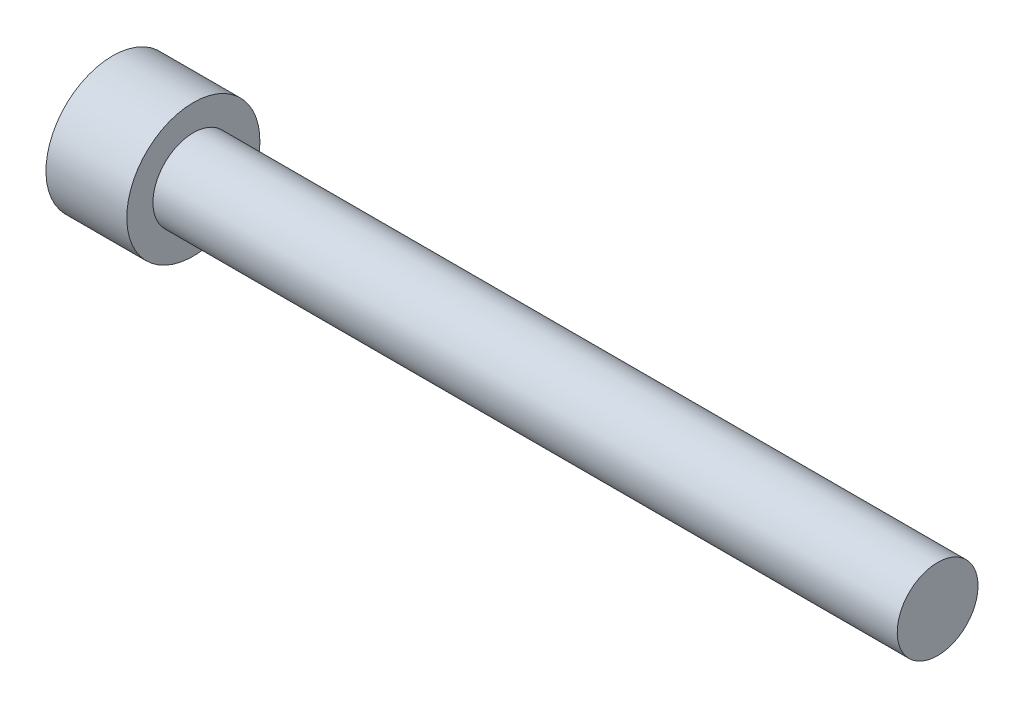
ISO-10303-21;
HEADER;
FILE_DESCRIPTION(('STEP AP214'),'2;1');
FILE_NAME('part.step','',(''),(''),'','','');
FILE_SCHEMA(('AUTOMOTIVE_DESIGN { 1 0 10303 214 1 1 1 1 }'));
ENDSEC;
DATA;
#1=APPLICATION_CONTEXT('core data for automotive mechanical design processes');
#2=APPLICATION_PROTOCOL_DEFINITION('international standard','automotive_design',2000,#1);
#3=PRODUCT_CONTEXT('',#1,'mechanical');
#4=PRODUCT('Part','Part','',(#3));
#5=PRODUCT_RELATED_PRODUCT_CATEGORY('part','',(#4));
#6=PRODUCT_DEFINITION_FORMATION('','',#4);
#7=PRODUCT_DEFINITION_CONTEXT('part definition',#1,'design');
#8=PRODUCT_DEFINITION('design','',#6,#7);
#9=PRODUCT_DEFINITION_SHAPE('','',#8);
#10=(LENGTH_UNIT() NAMED_UNIT(*) SI_UNIT(.MILLI.,.METRE.));
#11=(NAMED_UNIT(*) PLANE_ANGLE_UNIT() SI_UNIT($,.RADIAN.));
#12=(NAMED_UNIT(*) SI_UNIT($,.STERADIAN.) SOLID_ANGLE_UNIT());
#13=UNCERTAINTY_MEASURE_WITH_UNIT(LENGTH_MEASURE(1.E-05),#10,'distance_accuracy_value','');
#14=(GEOMETRIC_REPRESENTATION_CONTEXT(3) GLOBAL_UNCERTAINTY_ASSIGNED_CONTEXT((#13)) GLOBAL_UNIT_ASSIGNED_CONTEXT((#10,
#11,#12)) REPRESENTATION_CONTEXT('',''));
#15=CARTESIAN_POINT('',(0.,0.,0.));
#16=DIRECTION('',(0.,0.,1.));
#17=DIRECTION('',(1.,0.,0.));
#18=AXIS2_PLACEMENT_3D('',#15,#16,#17);
#19=CARTESIAN_POINT('',(0.,3.97509999999999,0.));
#20=DIRECTION('',(1.,0.,0.));
#21=DIRECTION('',(0.,1.,0.));
#22=AXIS2_PLACEMENT_3D('',#19,#20,#21);
#23=PLANE('',#22);
#24=CARTESIAN_POINT('',(0.,0.,0.));
#25=DIRECTION('',(1.,0.,0.));
#26=DIRECTION('',(0.,1.,0.));
#27=AXIS2_PLACEMENT_3D('',#24,#25,#26);
#28=CIRCLE('',#27,3.97509999999999);
#29=CARTESIAN_POINT('',(0.,3.97509999999999,0.));
#30=VERTEX_POINT('',#29);
#31=EDGE_CURVE('E10',#30,#30,#28,.T.);
#32=ORIENTED_EDGE('',*,*,#31,.T.);
#33=EDGE_LOOP('',(#32));
#34=FACE_BOUND('',#33,.T.);
#35=CARTESIAN_POINT('',(0.,0.,0.));
#36=DIRECTION('',(1.,0.,0.));
#37=DIRECTION('',(0.,1.,0.));
#38=AXIS2_PLACEMENT_3D('',#35,#36,#37);
#39=CIRCLE('',#38,2.41299999999999);
#40=CARTESIAN_POINT('',(0.,2.41299999999999,0.));
#41=VERTEX_POINT('',#40);
#42=EDGE_CURVE('E49',#41,#41,#39,.T.);
#43=ORIENTED_EDGE('',*,*,#42,.F.);
#44=EDGE_LOOP('',(#43));
#45=FACE_BOUND('',#44,.T.);
#46=ADVANCED_FACE('F35',(#34,#45),#23,.T.);
#47=CARTESIAN_POINT('',(44.45,0.,0.));
#48=DIRECTION('',(1.,0.,0.));
#49=DIRECTION('',(0.,1.,0.));
#50=AXIS2_PLACEMENT_3D('',#47,#48,#49);
#51=CYLINDRICAL_SURFACE('',#50,3.97509999999999);
#52=CARTESIAN_POINT('',(-4.826,0.,0.));
#53=DIRECTION('',(1.,0.,0.));
#54=DIRECTION('',(0.,1.,0.));
#55=AXIS2_PLACEMENT_3D('',#52,#53,#54);
#56=CIRCLE('',#55,3.97509999999999);
#57=CARTESIAN_POINT('',(-4.826,3.97509999999999,0.));
#58=VERTEX_POINT('',#57);
#59=EDGE_CURVE('E41',#58,#58,#56,.T.);
#60=ORIENTED_EDGE('',*,*,#59,.T.);
#61=EDGE_LOOP('',(#60));
#62=FACE_BOUND('',#61,.T.);
#63=ORIENTED_EDGE('',*,*,#31,.F.);
#64=EDGE_LOOP('',(#63));
#65=FACE_BOUND('',#64,.T.);
#66=ADVANCED_FACE('F59',(#62,#65),#51,.T.);
#67=CARTESIAN_POINT('',(-4.826,0.,0.));
#68=DIRECTION('',(-1.,0.,0.));
#69=DIRECTION('',(0.,-1.,0.));
#70=AXIS2_PLACEMENT_3D('',#67,#68,#69);
#71=PLANE('',#70);
#72=ORIENTED_EDGE('',*,*,#59,.F.);
#73=EDGE_LOOP('',(#72));
#74=FACE_BOUND('',#73,.T.);
#75=ADVANCED_FACE('F63',(#74),#71,.T.);
#76=CARTESIAN_POINT('',(44.45,2.41299999999999,0.));
#77=DIRECTION('',(1.,0.,0.));
#78=DIRECTION('',(0.,1.,0.));
#79=AXIS2_PLACEMENT_3D('',#76,#77,#78);
#80=PLANE('',#79);
#81=CARTESIAN_POINT('',(44.45,0.,0.));
#82=DIRECTION('',(1.,0.,0.));
#83=DIRECTION('',(0.,1.,0.));
#84=AXIS2_PLACEMENT_3D('',#81,#82,#83);
#85=CIRCLE('',#84,2.41299999999999);
#86=CARTESIAN_POINT('',(44.45,2.41299999999999,0.));
#87=VERTEX_POINT('',#86);
#88=EDGE_CURVE('E45',#87,#87,#85,.T.);
#89=ORIENTED_EDGE('',*,*,#88,.T.);
#90=EDGE_LOOP('',(#89));
#91=FACE_BOUND('',#90,.T.);
#92=ADVANCED_FACE('F67',(#91),#80,.T.);
#93=CARTESIAN_POINT('',(44.45,0.,0.));
#94=DIRECTION('',(1.,0.,0.));
#95=DIRECTION('',(0.,1.,0.));
#96=AXIS2_PLACEMENT_3D('',#93,#94,#95);
#97=CYLINDRICAL_SURFACE('',#96,2.41299999999999);
#98=ORIENTED_EDGE('',*,*,#42,.T.);
#99=EDGE_LOOP('',(#98));
#100=FACE_BOUND('',#99,.T.);
#101=ORIENTED_EDGE('',*,*,#88,.F.);
#102=EDGE_LOOP('',(#101));
#103=FACE_BOUND('',#102,.T.);
#104=ADVANCED_FACE('F55',(#100,#103),#97,.T.);
#105=CLOSED_SHELL('',(#46,#66,#75,#92,#104));
#106=MANIFOLD_SOLID_BREP('B2',#105);
#107=ADVANCED_BREP_SHAPE_REPRESENTATION('',(#18,#106),#14);
#108=SHAPE_DEFINITION_REPRESENTATION(#9,#107);
ENDSEC;
END-ISO-10303-21;
